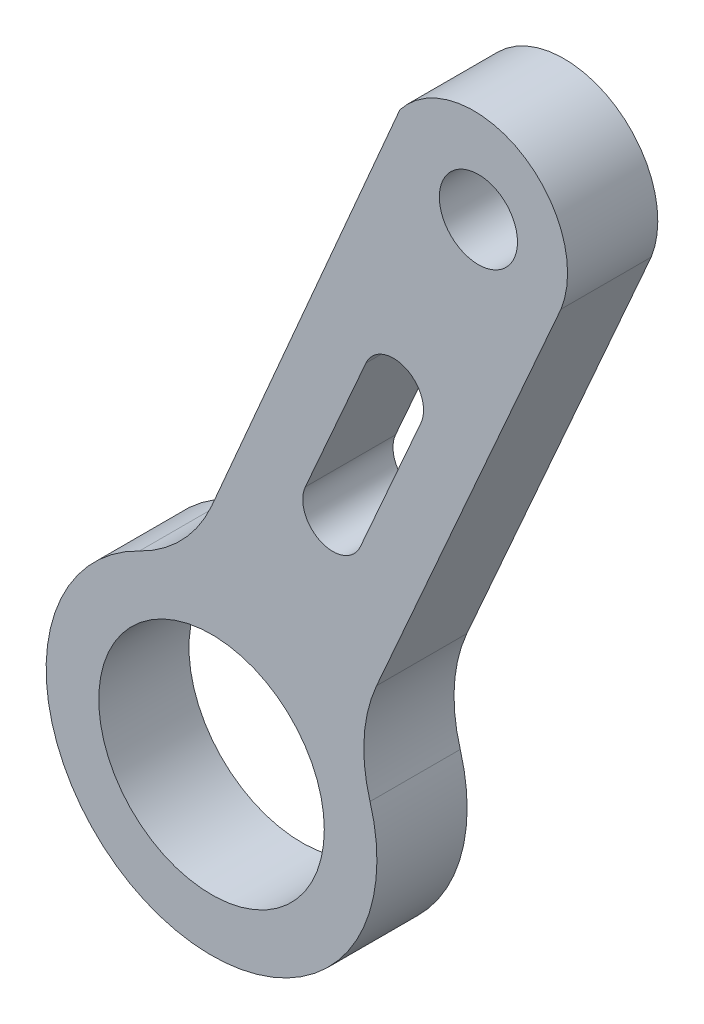
ISO-10303-21;
HEADER;
FILE_DESCRIPTION(('STEP AP214'),'2;1');
FILE_NAME('part.step','',(''),(''),'','','');
FILE_SCHEMA(('AUTOMOTIVE_DESIGN { 1 0 10303 214 1 1 1 1 }'));
ENDSEC;
DATA;
#1=APPLICATION_CONTEXT('core data for automotive mechanical design processes');
#2=APPLICATION_PROTOCOL_DEFINITION('international standard','automotive_design',2000,#1);
#3=PRODUCT_CONTEXT('',#1,'mechanical');
#4=PRODUCT('Part','Part','',(#3));
#5=PRODUCT_RELATED_PRODUCT_CATEGORY('part','',(#4));
#6=PRODUCT_DEFINITION_FORMATION('','',#4);
#7=PRODUCT_DEFINITION_CONTEXT('part definition',#1,'design');
#8=PRODUCT_DEFINITION('design','',#6,#7);
#9=PRODUCT_DEFINITION_SHAPE('','',#8);
#10=(LENGTH_UNIT() NAMED_UNIT(*) SI_UNIT(.MILLI.,.METRE.));
#11=(NAMED_UNIT(*) PLANE_ANGLE_UNIT() SI_UNIT($,.RADIAN.));
#12=(NAMED_UNIT(*) SI_UNIT($,.STERADIAN.) SOLID_ANGLE_UNIT());
#13=UNCERTAINTY_MEASURE_WITH_UNIT(LENGTH_MEASURE(1.E-05),#10,'distance_accuracy_value','');
#14=(GEOMETRIC_REPRESENTATION_CONTEXT(3) GLOBAL_UNCERTAINTY_ASSIGNED_CONTEXT((#13)) GLOBAL_UNIT_ASSIGNED_CONTEXT((#10,
#11,#12)) REPRESENTATION_CONTEXT('',''));
#15=CARTESIAN_POINT('',(0.,0.,0.));
#16=DIRECTION('',(0.,0.,1.));
#17=DIRECTION('',(1.,0.,0.));
#18=AXIS2_PLACEMENT_3D('',#15,#16,#17);
#19=CARTESIAN_POINT('',(48.2010842150199,32.6452387704734,3.));
#20=DIRECTION('',(0.,0.,1.));
#21=DIRECTION('',(1.,0.,0.));
#22=AXIS2_PLACEMENT_3D('',#19,#20,#21);
#23=PLANE('',#22);
#24=CARTESIAN_POINT('',(52.7779150108502,23.1952305568512,3.));
#25=DIRECTION('',(0.,0.,1.));
#26=DIRECTION('',(1.,0.,0.));
#27=AXIS2_PLACEMENT_3D('',#24,#25,#26);
#28=CIRCLE('',#27,3.75005000033333);
#29=CARTESIAN_POINT('',(56.5279650111835,23.1952305568512,3.));
#30=VERTEX_POINT('',#29);
#31=EDGE_CURVE('E152',#30,#30,#28,.T.);
#32=ORIENTED_EDGE('',*,*,#31,.F.);
#33=EDGE_LOOP('',(#32));
#34=FACE_BOUND('',#33,.T.);
#35=CARTESIAN_POINT('',(48.2010842150199,32.6452387704734,3.));
#36=DIRECTION('',(0.,0.,-1.));
#37=DIRECTION('',(1.,0.,0.));
#38=AXIS2_PLACEMENT_3D('',#35,#36,#37);
#39=CIRCLE('',#38,4.99997720740337);
#40=CARTESIAN_POINT('',(52.7761875724156,30.6282604999659,3.));
#41=VERTEX_POINT('',#40);
#42=CARTESIAN_POINT('',(50.3805203294092,28.1452576263075,3.));
#43=VERTEX_POINT('',#42);
#44=EDGE_CURVE('E158',#41,#43,#39,.T.);
#45=ORIENTED_EDGE('',*,*,#44,.T.);
#46=CARTESIAN_POINT('',(52.7779234162011,23.1952692043978,3.));
#47=DIRECTION('',(0.,0.,1.));
#48=DIRECTION('',(1.,0.,0.));
#49=AXIS2_PLACEMENT_3D('',#46,#47,#48);
#50=CIRCLE('',#49,5.49999335795959);
#51=CARTESIAN_POINT('',(58.0492872589046,24.7645525361893,3.));
#52=VERTEX_POINT('',#51);
#53=EDGE_CURVE('E161',#43,#52,#50,.T.);
#54=ORIENTED_EDGE('',*,*,#53,.T.);
#55=CARTESIAN_POINT('',(62.8413733632116,26.1909864204873,3.));
#56=DIRECTION('',(0.,0.,-1.));
#57=DIRECTION('',(1.,0.,0.));
#58=AXIS2_PLACEMENT_3D('',#55,#56,#57);
#59=CIRCLE('',#58,4.99988028430347);
#60=CARTESIAN_POINT('',(58.2663680875564,28.2079469022751,3.));
#61=VERTEX_POINT('',#60);
#62=EDGE_CURVE('E164',#52,#61,#59,.T.);
#63=ORIENTED_EDGE('',*,*,#62,.T.);
#64=DIRECTION('',(0.403385599619592,0.915030085854854,0.));
#65=VECTOR('',#64,1.);
#66=CARTESIAN_POINT('',(64.3975064932946,42.1156721832003,3.));
#67=LINE('',#66,#65);
#68=CARTESIAN_POINT('',(64.3975064932946,42.1156721832003,3.));
#69=VERTEX_POINT('',#68);
#70=EDGE_CURVE('E166',#61,#69,#67,.T.);
#71=ORIENTED_EDGE('',*,*,#70,.T.);
#72=CARTESIAN_POINT('',(61.5007631046618,43.2669761565153,3.));
#73=DIRECTION('',(0.,0.,1.));
#74=DIRECTION('',(1.,0.,0.));
#75=AXIS2_PLACEMENT_3D('',#72,#73,#74);
#76=CIRCLE('',#75,3.11714983575686);
#77=CARTESIAN_POINT('',(59.0407320972132,45.1813613165473,3.));
#78=VERTEX_POINT('',#77);
#79=EDGE_CURVE('E168',#69,#78,#76,.T.);
#80=ORIENTED_EDGE('',*,*,#79,.T.);
#81=DIRECTION('',(-0.39538519740572,-0.918515403067602,0.));
#82=VECTOR('',#81,1.);
#83=CARTESIAN_POINT('',(59.0407320972132,45.1813613165473,3.));
#84=LINE('',#83,#82);
#85=EDGE_CURVE('E170',#78,#41,#84,.T.);
#86=ORIENTED_EDGE('',*,*,#85,.T.);
#87=EDGE_LOOP('',(#45,#54,#63,#71,#80,#86));
#88=FACE_BOUND('',#87,.T.);
#89=CARTESIAN_POINT('',(61.6524162331947,43.3258289810752,3.));
#90=DIRECTION('',(0.,0.,1.));
#91=DIRECTION('',(1.,0.,0.));
#92=AXIS2_PLACEMENT_3D('',#89,#90,#91);
#93=CIRCLE('',#92,1.30000000192301);
#94=CARTESIAN_POINT('',(62.9524162351177,43.3258289810752,3.));
#95=VERTEX_POINT('',#94);
#96=EDGE_CURVE('E146',#95,#95,#93,.T.);
#97=ORIENTED_EDGE('',*,*,#96,.F.);
#98=EDGE_LOOP('',(#97));
#99=FACE_BOUND('',#98,.T.);
#100=DIRECTION('',(-0.403385599619578,-0.91503008585486,0.));
#101=VECTOR('',#100,1.);
#102=CARTESIAN_POINT('',(57.9137272910979,37.3240954837033,3.));
#103=LINE('',#102,#101);
#104=CARTESIAN_POINT('',(57.9137272910979,37.3240954837033,3.));
#105=VERTEX_POINT('',#104);
#106=CARTESIAN_POINT('',(55.8967992929993,32.7489450544274,3.));
#107=VERTEX_POINT('',#106);
#108=EDGE_CURVE('E118',#105,#107,#103,.T.);
#109=ORIENTED_EDGE('',*,*,#108,.F.);
#110=CARTESIAN_POINT('',(58.8287573769528,36.9207098840837,3.));
#111=DIRECTION('',(0.,0.,1.));
#112=DIRECTION('',(1.,0.,0.));
#113=AXIS2_PLACEMENT_3D('',#110,#111,#112);
#114=CIRCLE('',#113,0.999999999999987);
#115=CARTESIAN_POINT('',(59.7437874628076,36.5173242844641,3.));
#116=VERTEX_POINT('',#115);
#117=EDGE_CURVE('E110',#116,#105,#114,.T.);
#118=ORIENTED_EDGE('',*,*,#117,.F.);
#119=DIRECTION('',(0.40338559961957,0.915030085854864,0.));
#120=VECTOR('',#119,1.);
#121=CARTESIAN_POINT('',(59.7437874628076,36.5173242844641,3.));
#122=LINE('',#121,#120);
#123=CARTESIAN_POINT('',(57.726859464709,31.9421738551882,3.));
#124=VERTEX_POINT('',#123);
#125=EDGE_CURVE('E132',#124,#116,#122,.T.);
#126=ORIENTED_EDGE('',*,*,#125,.F.);
#127=CARTESIAN_POINT('',(56.8118293788542,32.3455594548078,3.));
#128=DIRECTION('',(0.,0.,1.));
#129=DIRECTION('',(1.,0.,0.));
#130=AXIS2_PLACEMENT_3D('',#127,#128,#129);
#131=CIRCLE('',#130,1.00000000000001);
#132=EDGE_CURVE('E130',#107,#124,#131,.T.);
#133=ORIENTED_EDGE('',*,*,#132,.F.);
#134=EDGE_LOOP('',(#109,#118,#126,#133));
#135=FACE_BOUND('',#134,.T.);
#136=ADVANCED_FACE('F33',(#34,#88,#99,#135),#23,.T.);
#137=CARTESIAN_POINT('',(48.2010842150199,32.6452387704734,0.));
#138=DIRECTION('',(0.,0.,1.));
#139=DIRECTION('',(1.,0.,0.));
#140=AXIS2_PLACEMENT_3D('',#137,#138,#139);
#141=PLANE('',#140);
#142=CARTESIAN_POINT('',(61.6524162331947,43.3258289810752,0.));
#143=DIRECTION('',(0.,0.,1.));
#144=DIRECTION('',(1.,0.,0.));
#145=AXIS2_PLACEMENT_3D('',#142,#143,#144);
#146=CIRCLE('',#145,1.30000000192301);
#147=CARTESIAN_POINT('',(62.9524162351177,43.3258289810752,0.));
#148=VERTEX_POINT('',#147);
#149=EDGE_CURVE('E126',#148,#148,#146,.T.);
#150=ORIENTED_EDGE('',*,*,#149,.T.);
#151=EDGE_LOOP('',(#150));
#152=FACE_BOUND('',#151,.T.);
#153=CARTESIAN_POINT('',(52.7779150108502,23.1952305568512,0.));
#154=DIRECTION('',(0.,0.,1.));
#155=DIRECTION('',(1.,0.,0.));
#156=AXIS2_PLACEMENT_3D('',#153,#154,#155);
#157=CIRCLE('',#156,3.75005000033333);
#158=CARTESIAN_POINT('',(56.5279650111835,23.1952305568512,0.));
#159=VERTEX_POINT('',#158);
#160=EDGE_CURVE('E149',#159,#159,#157,.T.);
#161=ORIENTED_EDGE('',*,*,#160,.T.);
#162=EDGE_LOOP('',(#161));
#163=FACE_BOUND('',#162,.T.);
#164=CARTESIAN_POINT('',(48.2010842150199,32.6452387704734,0.));
#165=DIRECTION('',(0.,0.,-1.));
#166=DIRECTION('',(1.,0.,0.));
#167=AXIS2_PLACEMENT_3D('',#164,#165,#166);
#168=CIRCLE('',#167,4.99997720740337);
#169=CARTESIAN_POINT('',(52.7761875724156,30.6282604999659,0.));
#170=VERTEX_POINT('',#169);
#171=CARTESIAN_POINT('',(50.3805203294092,28.1452576263075,0.));
#172=VERTEX_POINT('',#171);
#173=EDGE_CURVE('E155',#170,#172,#168,.T.);
#174=ORIENTED_EDGE('',*,*,#173,.F.);
#175=DIRECTION('',(-0.39538519740572,-0.918515403067602,0.));
#176=VECTOR('',#175,1.);
#177=CARTESIAN_POINT('',(59.0407320972132,45.1813613165473,0.));
#178=LINE('',#177,#176);
#179=CARTESIAN_POINT('',(59.0407320972132,45.1813613165473,0.));
#180=VERTEX_POINT('',#179);
#181=EDGE_CURVE('E162',#180,#170,#178,.T.);
#182=ORIENTED_EDGE('',*,*,#181,.F.);
#183=CARTESIAN_POINT('',(61.5007631046618,43.2669761565153,0.));
#184=DIRECTION('',(0.,0.,1.));
#185=DIRECTION('',(1.,0.,0.));
#186=AXIS2_PLACEMENT_3D('',#183,#184,#185);
#187=CIRCLE('',#186,3.11714983575686);
#188=CARTESIAN_POINT('',(64.3975064932946,42.1156721832003,0.));
#189=VERTEX_POINT('',#188);
#190=EDGE_CURVE('E181',#189,#180,#187,.T.);
#191=ORIENTED_EDGE('',*,*,#190,.F.);
#192=DIRECTION('',(0.403385599619592,0.915030085854854,0.));
#193=VECTOR('',#192,1.);
#194=CARTESIAN_POINT('',(64.3975064932946,42.1156721832003,0.));
#195=LINE('',#194,#193);
#196=CARTESIAN_POINT('',(58.2663680875564,28.2079469022751,0.));
#197=VERTEX_POINT('',#196);
#198=EDGE_CURVE('E179',#197,#189,#195,.T.);
#199=ORIENTED_EDGE('',*,*,#198,.F.);
#200=CARTESIAN_POINT('',(62.8413733632116,26.1909864204873,0.));
#201=DIRECTION('',(0.,0.,-1.));
#202=DIRECTION('',(1.,0.,0.));
#203=AXIS2_PLACEMENT_3D('',#200,#201,#202);
#204=CIRCLE('',#203,4.99988028430347);
#205=CARTESIAN_POINT('',(58.0492872589046,24.7645525361893,0.));
#206=VERTEX_POINT('',#205);
#207=EDGE_CURVE('E177',#206,#197,#204,.T.);
#208=ORIENTED_EDGE('',*,*,#207,.F.);
#209=CARTESIAN_POINT('',(52.7779234162011,23.1952692043978,0.));
#210=DIRECTION('',(0.,0.,1.));
#211=DIRECTION('',(1.,0.,0.));
#212=AXIS2_PLACEMENT_3D('',#209,#210,#211);
#213=CIRCLE('',#212,5.49999335795959);
#214=EDGE_CURVE('E175',#172,#206,#213,.T.);
#215=ORIENTED_EDGE('',*,*,#214,.F.);
#216=EDGE_LOOP('',(#174,#182,#191,#199,#208,#215));
#217=FACE_BOUND('',#216,.T.);
#218=CARTESIAN_POINT('',(58.8287573769528,36.9207098840837,0.));
#219=DIRECTION('',(0.,0.,1.));
#220=DIRECTION('',(1.,0.,0.));
#221=AXIS2_PLACEMENT_3D('',#218,#219,#220);
#222=CIRCLE('',#221,0.999999999999987);
#223=CARTESIAN_POINT('',(59.7437874628076,36.5173242844641,0.));
#224=VERTEX_POINT('',#223);
#225=CARTESIAN_POINT('',(57.9137272910979,37.3240954837033,0.));
#226=VERTEX_POINT('',#225);
#227=EDGE_CURVE('E56',#224,#226,#222,.T.);
#228=ORIENTED_EDGE('',*,*,#227,.T.);
#229=DIRECTION('',(-0.403385599619578,-0.91503008585486,0.));
#230=VECTOR('',#229,1.);
#231=CARTESIAN_POINT('',(57.9137272910979,37.3240954837033,0.));
#232=LINE('',#231,#230);
#233=CARTESIAN_POINT('',(55.8967992929993,32.7489450544274,0.));
#234=VERTEX_POINT('',#233);
#235=EDGE_CURVE('E125',#226,#234,#232,.T.);
#236=ORIENTED_EDGE('',*,*,#235,.T.);
#237=CARTESIAN_POINT('',(56.8118293788542,32.3455594548078,0.));
#238=DIRECTION('',(0.,0.,1.));
#239=DIRECTION('',(1.,0.,0.));
#240=AXIS2_PLACEMENT_3D('',#237,#238,#239);
#241=CIRCLE('',#240,1.00000000000001);
#242=CARTESIAN_POINT('',(57.726859464709,31.9421738551882,0.));
#243=VERTEX_POINT('',#242);
#244=EDGE_CURVE('E138',#234,#243,#241,.T.);
#245=ORIENTED_EDGE('',*,*,#244,.T.);
#246=DIRECTION('',(0.40338559961957,0.915030085854864,0.));
#247=VECTOR('',#246,1.);
#248=CARTESIAN_POINT('',(59.7437874628076,36.5173242844641,0.));
#249=LINE('',#248,#247);
#250=EDGE_CURVE('E119',#243,#224,#249,.T.);
#251=ORIENTED_EDGE('',*,*,#250,.T.);
#252=EDGE_LOOP('',(#228,#236,#245,#251));
#253=FACE_BOUND('',#252,.T.);
#254=ADVANCED_FACE('F205',(#152,#163,#217,#253),#141,.F.);
#255=CARTESIAN_POINT('',(48.2010842150199,32.6452387704734,3.));
#256=DIRECTION('',(0.,0.,-1.));
#257=DIRECTION('',(-1.,0.,0.));
#258=AXIS2_PLACEMENT_3D('',#255,#256,#257);
#259=CYLINDRICAL_SURFACE('',#258,4.99997720740337);
#260=ORIENTED_EDGE('',*,*,#173,.T.);
#261=DIRECTION('',(0.,0.,-1.));
#262=VECTOR('',#261,1.);
#263=CARTESIAN_POINT('',(50.3805203294092,28.1452576263075,3.));
#264=LINE('',#263,#262);
#265=EDGE_CURVE('E11',#43,#172,#264,.T.);
#266=ORIENTED_EDGE('',*,*,#265,.F.);
#267=ORIENTED_EDGE('',*,*,#44,.F.);
#268=DIRECTION('',(0.,0.,-1.));
#269=VECTOR('',#268,1.);
#270=CARTESIAN_POINT('',(52.7761875724156,30.6282604999659,3.));
#271=LINE('',#270,#269);
#272=EDGE_CURVE('E172',#41,#170,#271,.T.);
#273=ORIENTED_EDGE('',*,*,#272,.T.);
#274=EDGE_LOOP('',(#260,#266,#267,#273));
#275=FACE_BOUND('',#274,.T.);
#276=ADVANCED_FACE('F35',(#275),#259,.F.);
#277=CARTESIAN_POINT('',(52.7779234162011,23.1952692043978,3.));
#278=DIRECTION('',(0.,0.,-1.));
#279=DIRECTION('',(-1.,0.,0.));
#280=AXIS2_PLACEMENT_3D('',#277,#278,#279);
#281=CYLINDRICAL_SURFACE('',#280,5.49999335795959);
#282=ORIENTED_EDGE('',*,*,#214,.T.);
#283=DIRECTION('',(0.,0.,-1.));
#284=VECTOR('',#283,1.);
#285=CARTESIAN_POINT('',(58.0492872589046,24.7645525361893,3.));
#286=LINE('',#285,#284);
#287=EDGE_CURVE('E41',#52,#206,#286,.T.);
#288=ORIENTED_EDGE('',*,*,#287,.F.);
#289=ORIENTED_EDGE('',*,*,#53,.F.);
#290=ORIENTED_EDGE('',*,*,#265,.T.);
#291=EDGE_LOOP('',(#282,#288,#289,#290));
#292=FACE_BOUND('',#291,.T.);
#293=ADVANCED_FACE('F223',(#292),#281,.T.);
#294=CARTESIAN_POINT('',(62.8413733632116,26.1909864204873,3.));
#295=DIRECTION('',(0.,0.,-1.));
#296=DIRECTION('',(-1.,0.,0.));
#297=AXIS2_PLACEMENT_3D('',#294,#295,#296);
#298=CYLINDRICAL_SURFACE('',#297,4.99988028430347);
#299=ORIENTED_EDGE('',*,*,#207,.T.);
#300=DIRECTION('',(0.,0.,-1.));
#301=VECTOR('',#300,1.);
#302=CARTESIAN_POINT('',(58.2663680875564,28.2079469022751,3.));
#303=LINE('',#302,#301);
#304=EDGE_CURVE('E192',#61,#197,#303,.T.);
#305=ORIENTED_EDGE('',*,*,#304,.F.);
#306=ORIENTED_EDGE('',*,*,#62,.F.);
#307=ORIENTED_EDGE('',*,*,#287,.T.);
#308=EDGE_LOOP('',(#299,#305,#306,#307));
#309=FACE_BOUND('',#308,.T.);
#310=ADVANCED_FACE('F199',(#309),#298,.F.);
#311=CARTESIAN_POINT('',(64.3975064932946,42.1156721832003,3.));
#312=DIRECTION('',(-0.915030085854854,0.403385599619592,0.));
#313=DIRECTION('',(-0.403385599619592,-0.915030085854854,0.));
#314=AXIS2_PLACEMENT_3D('',#311,#312,#313);
#315=PLANE('',#314);
#316=ORIENTED_EDGE('',*,*,#198,.T.);
#317=DIRECTION('',(0.,0.,-1.));
#318=VECTOR('',#317,1.);
#319=CARTESIAN_POINT('',(64.3975064932946,42.1156721832003,3.));
#320=LINE('',#319,#318);
#321=EDGE_CURVE('E189',#69,#189,#320,.T.);
#322=ORIENTED_EDGE('',*,*,#321,.F.);
#323=ORIENTED_EDGE('',*,*,#70,.F.);
#324=ORIENTED_EDGE('',*,*,#304,.T.);
#325=EDGE_LOOP('',(#316,#322,#323,#324));
#326=FACE_BOUND('',#325,.T.);
#327=ADVANCED_FACE('F211',(#326),#315,.F.);
#328=CARTESIAN_POINT('',(61.5007631046618,43.2669761565153,3.));
#329=DIRECTION('',(0.,0.,-1.));
#330=DIRECTION('',(-1.,0.,0.));
#331=AXIS2_PLACEMENT_3D('',#328,#329,#330);
#332=CYLINDRICAL_SURFACE('',#331,3.11714983575686);
#333=ORIENTED_EDGE('',*,*,#190,.T.);
#334=DIRECTION('',(0.,0.,-1.));
#335=VECTOR('',#334,1.);
#336=CARTESIAN_POINT('',(59.0407320972132,45.1813613165473,3.));
#337=LINE('',#336,#335);
#338=EDGE_CURVE('E186',#78,#180,#337,.T.);
#339=ORIENTED_EDGE('',*,*,#338,.F.);
#340=ORIENTED_EDGE('',*,*,#79,.F.);
#341=ORIENTED_EDGE('',*,*,#321,.T.);
#342=EDGE_LOOP('',(#333,#339,#340,#341));
#343=FACE_BOUND('',#342,.T.);
#344=ADVANCED_FACE('F215',(#343),#332,.T.);
#345=CARTESIAN_POINT('',(59.0407320972132,45.1813613165473,3.));
#346=DIRECTION('',(0.918515403067602,-0.395385197405719,0.));
#347=DIRECTION('',(0.39538519740572,0.918515403067603,0.));
#348=AXIS2_PLACEMENT_3D('',#345,#346,#347);
#349=PLANE('',#348);
#350=ORIENTED_EDGE('',*,*,#181,.T.);
#351=ORIENTED_EDGE('',*,*,#272,.F.);
#352=ORIENTED_EDGE('',*,*,#85,.F.);
#353=ORIENTED_EDGE('',*,*,#338,.T.);
#354=EDGE_LOOP('',(#350,#351,#352,#353));
#355=FACE_BOUND('',#354,.T.);
#356=ADVANCED_FACE('F226',(#355),#349,.F.);
#357=CARTESIAN_POINT('',(52.7779150108502,23.1952305568512,3.));
#358=DIRECTION('',(0.,0.,-1.));
#359=DIRECTION('',(-1.,0.,0.));
#360=AXIS2_PLACEMENT_3D('',#357,#358,#359);
#361=CYLINDRICAL_SURFACE('',#360,3.75005000033333);
#362=ORIENTED_EDGE('',*,*,#31,.T.);
#363=EDGE_LOOP('',(#362));
#364=FACE_BOUND('',#363,.T.);
#365=ORIENTED_EDGE('',*,*,#160,.F.);
#366=EDGE_LOOP('',(#365));
#367=FACE_BOUND('',#366,.T.);
#368=ADVANCED_FACE('F228',(#364,#367),#361,.F.);
#369=CARTESIAN_POINT('',(61.6524162331947,43.3258289810752,3.));
#370=DIRECTION('',(0.,0.,-1.));
#371=DIRECTION('',(-1.,0.,0.));
#372=AXIS2_PLACEMENT_3D('',#369,#370,#371);
#373=CYLINDRICAL_SURFACE('',#372,1.30000000192301);
#374=ORIENTED_EDGE('',*,*,#96,.T.);
#375=EDGE_LOOP('',(#374));
#376=FACE_BOUND('',#375,.T.);
#377=ORIENTED_EDGE('',*,*,#149,.F.);
#378=EDGE_LOOP('',(#377));
#379=FACE_BOUND('',#378,.T.);
#380=ADVANCED_FACE('F234',(#376,#379),#373,.F.);
#381=CARTESIAN_POINT('',(58.8287573769528,36.9207098840837,3.));
#382=DIRECTION('',(0.,0.,-1.));
#383=DIRECTION('',(-1.,0.,0.));
#384=AXIS2_PLACEMENT_3D('',#381,#382,#383);
#385=CYLINDRICAL_SURFACE('',#384,0.999999999999987);
#386=ORIENTED_EDGE('',*,*,#227,.F.);
#387=DIRECTION('',(0.,0.,-1.));
#388=VECTOR('',#387,1.);
#389=CARTESIAN_POINT('',(59.7437874628076,36.5173242844641,3.));
#390=LINE('',#389,#388);
#391=EDGE_CURVE('E114',#116,#224,#390,.T.);
#392=ORIENTED_EDGE('',*,*,#391,.F.);
#393=ORIENTED_EDGE('',*,*,#117,.T.);
#394=DIRECTION('',(0.,0.,-1.));
#395=VECTOR('',#394,1.);
#396=CARTESIAN_POINT('',(57.9137272910979,37.3240954837033,3.));
#397=LINE('',#396,#395);
#398=EDGE_CURVE('E113',#105,#226,#397,.T.);
#399=ORIENTED_EDGE('',*,*,#398,.T.);
#400=EDGE_LOOP('',(#386,#392,#393,#399));
#401=FACE_BOUND('',#400,.T.);
#402=ADVANCED_FACE('F112',(#401),#385,.F.);
#403=CARTESIAN_POINT('',(57.9137272910979,37.3240954837033,3.));
#404=DIRECTION('',(0.91503008585486,-0.403385599619578,0.));
#405=DIRECTION('',(0.403385599619578,0.915030085854861,0.));
#406=AXIS2_PLACEMENT_3D('',#403,#404,#405);
#407=PLANE('',#406);
#408=ORIENTED_EDGE('',*,*,#235,.F.);
#409=ORIENTED_EDGE('',*,*,#398,.F.);
#410=ORIENTED_EDGE('',*,*,#108,.T.);
#411=DIRECTION('',(0.,0.,-1.));
#412=VECTOR('',#411,1.);
#413=CARTESIAN_POINT('',(55.8967992929993,32.7489450544274,3.));
#414=LINE('',#413,#412);
#415=EDGE_CURVE('E127',#107,#234,#414,.T.);
#416=ORIENTED_EDGE('',*,*,#415,.T.);
#417=EDGE_LOOP('',(#408,#409,#410,#416));
#418=FACE_BOUND('',#417,.T.);
#419=ADVANCED_FACE('F122',(#418),#407,.T.);
#420=CARTESIAN_POINT('',(56.8118293788542,32.3455594548078,3.));
#421=DIRECTION('',(0.,0.,-1.));
#422=DIRECTION('',(-1.,0.,0.));
#423=AXIS2_PLACEMENT_3D('',#420,#421,#422);
#424=CYLINDRICAL_SURFACE('',#423,1.00000000000001);
#425=ORIENTED_EDGE('',*,*,#244,.F.);
#426=ORIENTED_EDGE('',*,*,#415,.F.);
#427=ORIENTED_EDGE('',*,*,#132,.T.);
#428=DIRECTION('',(0.,0.,-1.));
#429=VECTOR('',#428,1.);
#430=CARTESIAN_POINT('',(57.726859464709,31.9421738551882,3.));
#431=LINE('',#430,#429);
#432=EDGE_CURVE('E48',#124,#243,#431,.T.);
#433=ORIENTED_EDGE('',*,*,#432,.T.);
#434=EDGE_LOOP('',(#425,#426,#427,#433));
#435=FACE_BOUND('',#434,.T.);
#436=ADVANCED_FACE('F255',(#435),#424,.F.);
#437=CARTESIAN_POINT('',(59.7437874628076,36.5173242844641,3.));
#438=DIRECTION('',(-0.915030085854864,0.40338559961957,0.));
#439=DIRECTION('',(-0.40338559961957,-0.915030085854864,0.));
#440=AXIS2_PLACEMENT_3D('',#437,#438,#439);
#441=PLANE('',#440);
#442=ORIENTED_EDGE('',*,*,#250,.F.);
#443=ORIENTED_EDGE('',*,*,#432,.F.);
#444=ORIENTED_EDGE('',*,*,#125,.T.);
#445=ORIENTED_EDGE('',*,*,#391,.T.);
#446=EDGE_LOOP('',(#442,#443,#444,#445));
#447=FACE_BOUND('',#446,.T.);
#448=ADVANCED_FACE('F258',(#447),#441,.T.);
#449=CLOSED_SHELL('',(#136,#254,#276,#293,#310,#327,#344,#356,#368,#380,#402,#419,#436,#448));
#450=MANIFOLD_SOLID_BREP('B2',#449);
#451=ADVANCED_BREP_SHAPE_REPRESENTATION('',(#18,#450),#14);
#452=SHAPE_DEFINITION_REPRESENTATION(#9,#451);
ENDSEC;
END-ISO-10303-21;
